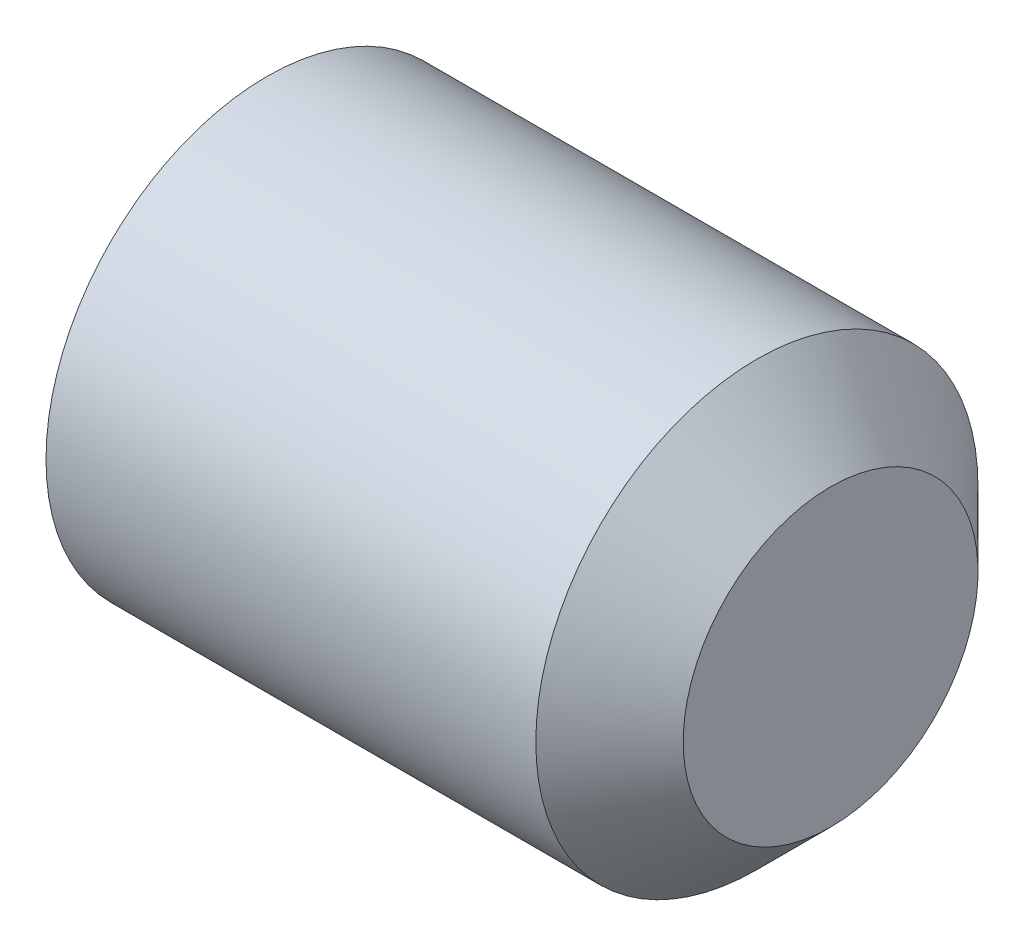
ISO-10303-21;
HEADER;
FILE_DESCRIPTION(('STEP AP214'),'2;1');
FILE_NAME('part.step','',(''),(''),'','','');
FILE_SCHEMA(('AUTOMOTIVE_DESIGN { 1 0 10303 214 1 1 1 1 }'));
ENDSEC;
DATA;
#1=APPLICATION_CONTEXT('core data for automotive mechanical design processes');
#2=APPLICATION_PROTOCOL_DEFINITION('international standard','automotive_design',2000,#1);
#3=PRODUCT_CONTEXT('',#1,'mechanical');
#4=PRODUCT('Part','Part','',(#3));
#5=PRODUCT_RELATED_PRODUCT_CATEGORY('part','',(#4));
#6=PRODUCT_DEFINITION_FORMATION('','',#4);
#7=PRODUCT_DEFINITION_CONTEXT('part definition',#1,'design');
#8=PRODUCT_DEFINITION('design','',#6,#7);
#9=PRODUCT_DEFINITION_SHAPE('','',#8);
#10=(LENGTH_UNIT() NAMED_UNIT(*) SI_UNIT(.MILLI.,.METRE.));
#11=(NAMED_UNIT(*) PLANE_ANGLE_UNIT() SI_UNIT($,.RADIAN.));
#12=(NAMED_UNIT(*) SI_UNIT($,.STERADIAN.) SOLID_ANGLE_UNIT());
#13=UNCERTAINTY_MEASURE_WITH_UNIT(LENGTH_MEASURE(1.E-05),#10,'distance_accuracy_value','');
#14=(GEOMETRIC_REPRESENTATION_CONTEXT(3) GLOBAL_UNCERTAINTY_ASSIGNED_CONTEXT((#13)) GLOBAL_UNIT_ASSIGNED_CONTEXT((#10,
#11,#12)) REPRESENTATION_CONTEXT('',''));
#15=CARTESIAN_POINT('',(0.,0.,0.));
#16=DIRECTION('',(0.,0.,1.));
#17=DIRECTION('',(1.,0.,0.));
#18=AXIS2_PLACEMENT_3D('',#15,#16,#17);
#19=CARTESIAN_POINT('',(0.5,0.,0.));
#20=DIRECTION('',(-1.,0.,0.));
#21=DIRECTION('',(0.,-1.,0.));
#22=AXIS2_PLACEMENT_3D('',#19,#20,#21);
#23=CONICAL_SURFACE('',#22,0.,1.0471975511966);
#24=CARTESIAN_POINT('',(0.,0.,0.));
#25=DIRECTION('',(-1.,0.,0.));
#26=DIRECTION('',(0.,-1.,0.));
#27=AXIS2_PLACEMENT_3D('',#24,#25,#26);
#28=CIRCLE('',#27,0.86602540378444);
#29=CARTESIAN_POINT('',(0.,0.,0.86602540378444));
#30=VERTEX_POINT('',#29);
#31=CARTESIAN_POINT('',(0.,0.75,0.433012701892223));
#32=VERTEX_POINT('',#31);
#33=EDGE_CURVE('E133',#30,#32,#28,.T.);
#34=ORIENTED_EDGE('',*,*,#33,.T.);
#35=CARTESIAN_POINT('',(-6.66799982212228E-05,0.7502,0.432897231838382));
#36=CARTESIAN_POINT('',(0.010927967254595,0.717238666576004,0.451927466563575));
#37=CARTESIAN_POINT('',(0.0209278588304375,0.68399281869625,0.471121965786389));
#38=CARTESIAN_POINT('',(0.0383842880739243,0.616925218141244,0.509843463020724));
#39=CARTESIAN_POINT('',(0.0458346476710159,0.583102272153654,0.529371149991445));
#40=CARTESIAN_POINT('',(0.0574342962607429,0.515875632570363,0.568184468451572));
#41=CARTESIAN_POINT('',(0.0616607517951382,0.482482293499614,0.58746412175321));
#42=CARTESIAN_POINT('',(0.0667098540533311,0.415538173911306,0.626114327218181));
#43=CARTESIAN_POINT('',(0.0675366780658329,0.381987637355587,0.645484738530082));
#44=CARTESIAN_POINT('',(0.0658332319602483,0.319275698978883,0.681691493033275));
#45=CARTESIAN_POINT('',(0.0637212206264609,0.290104995811374,0.698533206359488));
#46=CARTESIAN_POINT('',(0.0570222121958376,0.231953671848458,0.732106888903211));
#47=CARTESIAN_POINT('',(0.052432918046532,0.202973252776875,0.748838741655417));
#48=CARTESIAN_POINT('',(0.0409580031195667,0.144701650655193,0.782481866826481));
#49=CARTESIAN_POINT('',(0.0340236523302117,0.115417857581381,0.79938887264054));
#50=CARTESIAN_POINT('',(0.0182846224056371,0.0572874895838317,0.832950456252017));
#51=CARTESIAN_POINT('',(0.00948365081374601,0.0284401676519286,0.849605465334801));
#52=CARTESIAN_POINT('',(-6.66799982218375E-05,-0.000200000000000055,0.866140873838278));
#53=B_SPLINE_CURVE_WITH_KNOTS('',3,(#35,#36,#37,#38,#39,#40,#41,#42,#43,#44,#45,#46,#47,#48,#49,
#50,#51,#52),.UNSPECIFIED.,.F.,.F.,(4,2,2,2,2,2,2,2,4),(0.,0.118896819359341,0.238079744533805,
0.354311719456401,0.470400831872515,0.571553114284105,0.672799351342655,0.776293900714049,
0.87958477934405),.UNSPECIFIED.);
#54=EDGE_CURVE('E11',#32,#30,#53,.T.);
#55=ORIENTED_EDGE('',*,*,#54,.T.);
#56=EDGE_LOOP('',(#34,#55));
#57=FACE_BOUND('',#56,.T.);
#58=ADVANCED_FACE('F31',(#57),#23,.F.);
#59=CARTESIAN_POINT('',(0.,-0.75,0.43301270189222));
#60=VERTEX_POINT('',#59);
#61=EDGE_CURVE('E129',#60,#30,#28,.T.);
#62=ORIENTED_EDGE('',*,*,#61,.T.);
#63=CARTESIAN_POINT('',(-6.66799982219239E-05,0.000200000000000024,0.866140873838278));
#64=CARTESIAN_POINT('',(0.0109279672545945,-0.0327613334239957,0.847110639113085));
#65=CARTESIAN_POINT('',(0.0209278588304371,-0.0660071813037501,0.827916139890271));
#66=CARTESIAN_POINT('',(0.0383842880739239,-0.133074781858756,0.789194642655936));
#67=CARTESIAN_POINT('',(0.0458346476710155,-0.166897727846346,0.769666955685215));
#68=CARTESIAN_POINT('',(0.0574342962607427,-0.234124367429637,0.730853637225088));
#69=CARTESIAN_POINT('',(0.0616607517951381,-0.267517706500386,0.71157398392345));
#70=CARTESIAN_POINT('',(0.0667098540533311,-0.334461826088694,0.672923778458478));
#71=CARTESIAN_POINT('',(0.0675366780658328,-0.368012362644413,0.653553367146578));
#72=CARTESIAN_POINT('',(0.0658332319602483,-0.430724301021117,0.617346612643384));
#73=CARTESIAN_POINT('',(0.063721220626461,-0.459895004188626,0.600504899317172));
#74=CARTESIAN_POINT('',(0.0570222121958378,-0.518046328151542,0.566931216773449));
#75=CARTESIAN_POINT('',(0.0524329180465322,-0.547026747223126,0.550199364021243));
#76=CARTESIAN_POINT('',(0.040958003119567,-0.605298349344807,0.516556238850179));
#77=CARTESIAN_POINT('',(0.0340236523302121,-0.63458214241862,0.49964923303612));
#78=CARTESIAN_POINT('',(0.0182846224056376,-0.692712510416168,0.466087649424643));
#79=CARTESIAN_POINT('',(0.00948365081374657,-0.721559832348072,0.449432640341859));
#80=CARTESIAN_POINT('',(-6.66799982212897E-05,-0.7502,0.432897231838382));
#81=B_SPLINE_CURVE_WITH_KNOTS('',3,(#63,#64,#65,#66,#67,#68,#69,#70,#71,#72,#73,#74,#75,#76,#77,
#78,#79,#80),.UNSPECIFIED.,.F.,.F.,(4,2,2,2,2,2,2,2,4),(0.,0.118896819359341,0.238079744533806,
0.354311719456402,0.470400831872516,0.571553114284106,0.672799351342656,0.776293900714049,
0.87958477934405),.UNSPECIFIED.);
#82=EDGE_CURVE('E44',#30,#60,#81,.T.);
#83=ORIENTED_EDGE('',*,*,#82,.T.);
#84=EDGE_LOOP('',(#62,#83));
#85=FACE_BOUND('',#84,.T.);
#86=ADVANCED_FACE('F199',(#85),#23,.F.);
#87=CARTESIAN_POINT('',(0.,-0.75,-0.43301270189222));
#88=VERTEX_POINT('',#87);
#89=EDGE_CURVE('E128',#88,#60,#28,.T.);
#90=ORIENTED_EDGE('',*,*,#89,.T.);
#91=CARTESIAN_POINT('',(-0.278876466554599,-0.75,-1.1213588410753));
#92=CARTESIAN_POINT('',(-0.263336265513847,-0.75,-1.08897094569566));
#93=CARTESIAN_POINT('',(-0.247960254101357,-0.75,-1.05650461769235));
#94=CARTESIAN_POINT('',(-0.217622574828427,-0.75,-0.991372108674821));
#95=CARTESIAN_POINT('',(-0.202660981535683,-0.75,-0.958705892968622));
#96=CARTESIAN_POINT('',(-0.158358865523062,-0.75,-0.859967547804009));
#97=CARTESIAN_POINT('',(-0.129789394165183,-0.75,-0.793542929389712));
#98=CARTESIAN_POINT('',(-0.0751843648621229,-0.75,-0.65762475062518));
#99=CARTESIAN_POINT('',(-0.0492343798449783,-0.75,-0.588096337629301));
#100=CARTESIAN_POINT('',(-0.00305510516041315,-0.75,-0.4472488091812));
#101=CARTESIAN_POINT('',(0.0171890364428778,-0.75,-0.375934878791921));
#102=CARTESIAN_POINT('',(0.0406681724723914,-0.75,-0.267524989845908));
#103=CARTESIAN_POINT('',(0.0473436760874131,-0.75,-0.23118312239164));
#104=CARTESIAN_POINT('',(0.0579431761785596,-0.75,-0.15809165305082));
#105=CARTESIAN_POINT('',(0.0618673585946983,-0.75,-0.121342078888484));
#106=CARTESIAN_POINT('',(0.0666007642621428,-0.75,-0.0480795367926937));
#107=CARTESIAN_POINT('',(0.067446746241503,-0.75,-0.0115690096358277));
#108=CARTESIAN_POINT('',(0.0660502662725583,-0.75,0.0613915172782877));
#109=CARTESIAN_POINT('',(0.0638076130857625,-0.75,0.0978415131477214));
#110=CARTESIAN_POINT('',(0.0546612587546508,-0.75,0.187777191706421));
#111=CARTESIAN_POINT('',(0.0460435794249813,-0.75,0.241088938334563));
#112=CARTESIAN_POINT('',(0.0238197624153013,-0.75,0.346671776891812));
#113=CARTESIAN_POINT('',(0.0102076124427648,-0.75,0.398941534194197));
#114=CARTESIAN_POINT('',(-0.0209022912180242,-0.75,0.503561794942341));
#115=CARTESIAN_POINT('',(-0.0384803755428799,-0.75,0.555887795146071));
#116=CARTESIAN_POINT('',(-0.0761733658266928,-0.75,0.65957873858857));
#117=CARTESIAN_POINT('',(-0.0962873812846859,-0.75,0.710944011954183));
#118=CARTESIAN_POINT('',(-0.150040559931433,-0.75,0.841609169334977));
#119=CARTESIAN_POINT('',(-0.184929491266454,-0.75,0.92038989884234));
#120=CARTESIAN_POINT('',(-0.257158245348334,-0.75,1.07682093489163));
#121=CARTESIAN_POINT('',(-0.294498696792946,-0.75,1.15447094517097));
#122=CARTESIAN_POINT('',(-0.370753350440448,-0.75,1.30910230028643));
#123=CARTESIAN_POINT('',(-0.409669312305081,-0.75,1.38608277390296));
#124=CARTESIAN_POINT('',(-0.488505273193592,-0.75,1.53952831971992));
#125=CARTESIAN_POINT('',(-0.528425305368566,-0.75,1.61599337479695));
#126=CARTESIAN_POINT('',(-0.6051521411833,-0.75,1.76135282602859));
#127=CARTESIAN_POINT('',(-0.641896830705147,-0.75,1.83028007942956));
#128=CARTESIAN_POINT('',(-0.715804702425085,-0.75,1.9679128537899));
#129=CARTESIAN_POINT('',(-0.752967900110791,-0.75,2.0366183664215));
#130=CARTESIAN_POINT('',(-0.827513082986853,-0.75,2.17368403451686));
#131=CARTESIAN_POINT('',(-0.864894271247797,-0.75,2.24204462391346));
#132=CARTESIAN_POINT('',(-0.939899942981135,-0.75,2.37862759491475));
#133=CARTESIAN_POINT('',(-0.97752441361878,-0.75,2.44684998356505));
#134=CARTESIAN_POINT('',(-1.01523807504823,-0.75,2.51502271803409));
#135=B_SPLINE_CURVE_WITH_KNOTS('',3,(#91,#92,#93,#94,#95,#96,#97,#98,#99,#100,#101,#102,#103,
#104,#105,#106,#107,#108,#109,#110,#111,#112,#113,#114,#115,#116,#117,#118,#119,#120,#121,#122,
#123,#124,#125,#126,#127,#128,#129,#130,#131,#132,#133,#134),.UNSPECIFIED.,.F.,.F.,(4,2,2,2,2,2,
2,2,2,2,2,2,2,2,2,2,2,2,2,2,2,4),(0.,0.107767756928781,0.215554780551915,0.432420251910877,
0.654944617818952,0.876884302501298,0.987647541221339,1.0984032936094,1.20783201912744,
1.31726752042964,1.47894399847129,1.64081574297878,1.8063195007273,1.97176530228984,
2.23016383407581,2.48862889356041,2.74739105429863,3.00616176975601,3.24048926348677,
3.47482545759373,3.70856560604661,3.94229352217274),.UNSPECIFIED.);
#136=EDGE_CURVE('E175',#60,#88,#135,.F.);
#137=ORIENTED_EDGE('',*,*,#136,.T.);
#138=EDGE_LOOP('',(#90,#137));
#139=FACE_BOUND('',#138,.T.);
#140=ADVANCED_FACE('F205',(#139),#23,.F.);
#141=CARTESIAN_POINT('',(0.,0.,-0.86602540378444));
#142=VERTEX_POINT('',#141);
#143=EDGE_CURVE('E227',#142,#88,#28,.T.);
#144=ORIENTED_EDGE('',*,*,#143,.T.);
#145=CARTESIAN_POINT('',(-6.66799982213668E-05,-0.7502,-0.432897231838382));
#146=CARTESIAN_POINT('',(0.0109279672545949,-0.717238666576004,-0.451927466563575));
#147=CARTESIAN_POINT('',(0.0209278588304375,-0.68399281869625,-0.471121965786389));
#148=CARTESIAN_POINT('',(0.0383842880739244,-0.616925218141244,-0.509843463020723));
#149=CARTESIAN_POINT('',(0.045834647671016,-0.583102272153655,-0.529371149991445));
#150=CARTESIAN_POINT('',(0.057434296260743,-0.515875632570363,-0.568184468451572));
#151=CARTESIAN_POINT('',(0.0616607517951382,-0.482482293499614,-0.587464121753209));
#152=CARTESIAN_POINT('',(0.0667098540533311,-0.415538173911306,-0.626114327218181));
#153=CARTESIAN_POINT('',(0.0675366780658329,-0.381987637355587,-0.645484738530082));
#154=CARTESIAN_POINT('',(0.0658332319602482,-0.319275698978883,-0.681691493033275));
#155=CARTESIAN_POINT('',(0.0637212206264608,-0.290104995811374,-0.698533206359488));
#156=CARTESIAN_POINT('',(0.0570222121958375,-0.231953671848458,-0.732106888903211));
#157=CARTESIAN_POINT('',(0.052432918046532,-0.202973252776875,-0.748838741655417));
#158=CARTESIAN_POINT('',(0.0409580031195667,-0.144701650655193,-0.782481866826481));
#159=CARTESIAN_POINT('',(0.0340236523302117,-0.115417857581381,-0.79938887264054));
#160=CARTESIAN_POINT('',(0.018284622405637,-0.0572874895838317,-0.832950456252017));
#161=CARTESIAN_POINT('',(0.00948365081374596,-0.0284401676519285,-0.849605465334801));
#162=CARTESIAN_POINT('',(-6.6679998221836E-05,0.000199999999999981,-0.866140873838278));
#163=B_SPLINE_CURVE_WITH_KNOTS('',3,(#145,#146,#147,#148,#149,#150,#151,#152,#153,#154,#155,
#156,#157,#158,#159,#160,#161,#162),.UNSPECIFIED.,.F.,.F.,(4,2,2,2,2,2,2,2,4),(0.,
0.118896819359341,0.238079744533805,0.354311719456401,0.470400831872515,0.571553114284105,
0.672799351342655,0.776293900714049,0.87958477934405),.UNSPECIFIED.);
#164=EDGE_CURVE('E170',#88,#142,#163,.T.);
#165=ORIENTED_EDGE('',*,*,#164,.T.);
#166=EDGE_LOOP('',(#144,#165));
#167=FACE_BOUND('',#166,.T.);
#168=ADVANCED_FACE('F217',(#167),#23,.F.);
#169=CARTESIAN_POINT('',(0.,0.75,-0.43301270189222));
#170=VERTEX_POINT('',#169);
#171=EDGE_CURVE('E225',#170,#142,#28,.T.);
#172=ORIENTED_EDGE('',*,*,#171,.T.);
#173=CARTESIAN_POINT('',(-6.66799982219239E-05,-0.000200000000000024,-0.866140873838278));
#174=CARTESIAN_POINT('',(0.0109279672545945,0.0327613334239957,-0.847110639113085));
#175=CARTESIAN_POINT('',(0.0209278588304371,0.0660071813037502,-0.827916139890271));
#176=CARTESIAN_POINT('',(0.038384288073924,0.133074781858756,-0.789194642655936));
#177=CARTESIAN_POINT('',(0.0458346476710156,0.166897727846346,-0.769666955685215));
#178=CARTESIAN_POINT('',(0.0574342962607428,0.234124367429637,-0.730853637225088));
#179=CARTESIAN_POINT('',(0.0616607517951381,0.267517706500386,-0.71157398392345));
#180=CARTESIAN_POINT('',(0.0667098540533311,0.334461826088694,-0.672923778458478));
#181=CARTESIAN_POINT('',(0.067536678065833,0.368012362644413,-0.653553367146578));
#182=CARTESIAN_POINT('',(0.0658332319602484,0.430724301021117,-0.617346612643384));
#183=CARTESIAN_POINT('',(0.063721220626461,0.459895004188626,-0.600504899317172));
#184=CARTESIAN_POINT('',(0.0570222121958378,0.518046328151543,-0.566931216773449));
#185=CARTESIAN_POINT('',(0.0524329180465322,0.547026747223125,-0.550199364021243));
#186=CARTESIAN_POINT('',(0.040958003119567,0.605298349344807,-0.516556238850179));
#187=CARTESIAN_POINT('',(0.0340236523302121,0.634582142418619,-0.49964923303612));
#188=CARTESIAN_POINT('',(0.0182846224056376,0.692712510416168,-0.466087649424643));
#189=CARTESIAN_POINT('',(0.00948365081374655,0.721559832348072,-0.449432640341859));
#190=CARTESIAN_POINT('',(-6.66799982212116E-05,0.7502,-0.432897231838382));
#191=B_SPLINE_CURVE_WITH_KNOTS('',3,(#173,#174,#175,#176,#177,#178,#179,#180,#181,#182,#183,
#184,#185,#186,#187,#188,#189,#190),.UNSPECIFIED.,.F.,.F.,(4,2,2,2,2,2,2,2,4),(0.,
0.118896819359341,0.238079744533806,0.354311719456402,0.470400831872516,0.571553114284106,
0.672799351342656,0.776293900714049,0.87958477934405),.UNSPECIFIED.);
#192=EDGE_CURVE('E111',#142,#170,#191,.T.);
#193=ORIENTED_EDGE('',*,*,#192,.T.);
#194=EDGE_LOOP('',(#172,#193));
#195=FACE_BOUND('',#194,.T.);
#196=ADVANCED_FACE('F209',(#195),#23,.F.);
#197=EDGE_CURVE('E221',#32,#170,#28,.T.);
#198=ORIENTED_EDGE('',*,*,#197,.T.);
#199=CARTESIAN_POINT('',(-0.278876466554599,0.75,-1.1213588410753));
#200=CARTESIAN_POINT('',(-0.263336265513847,0.75,-1.08897094569566));
#201=CARTESIAN_POINT('',(-0.247960254101357,0.75,-1.05650461769235));
#202=CARTESIAN_POINT('',(-0.217622574828427,0.75,-0.991372108674821));
#203=CARTESIAN_POINT('',(-0.202660981535683,0.75,-0.958705892968622));
#204=CARTESIAN_POINT('',(-0.158358865523062,0.75,-0.859967547804009));
#205=CARTESIAN_POINT('',(-0.129789394165183,0.75,-0.793542929389712));
#206=CARTESIAN_POINT('',(-0.0751843648621227,0.75,-0.657624750625179));
#207=CARTESIAN_POINT('',(-0.0492343798449782,0.75,-0.588096337629301));
#208=CARTESIAN_POINT('',(-0.00305510516041308,0.75,-0.4472488091812));
#209=CARTESIAN_POINT('',(0.0171890364428778,0.75,-0.375934878791921));
#210=CARTESIAN_POINT('',(0.0406681724723914,0.75,-0.267524989845907));
#211=CARTESIAN_POINT('',(0.0473436760874131,0.75,-0.23118312239164));
#212=CARTESIAN_POINT('',(0.0579431761785596,0.75,-0.15809165305082));
#213=CARTESIAN_POINT('',(0.0618673585946983,0.75,-0.121342078888484));
#214=CARTESIAN_POINT('',(0.0666007642621429,0.75,-0.0480795367926939));
#215=CARTESIAN_POINT('',(0.067446746241503,0.75,-0.011569009635828));
#216=CARTESIAN_POINT('',(0.0660502662725583,0.75,0.0613915172782875));
#217=CARTESIAN_POINT('',(0.0638076130857626,0.75,0.0978415131477212));
#218=CARTESIAN_POINT('',(0.0546612587546508,0.75,0.18777719170642));
#219=CARTESIAN_POINT('',(0.0460435794249812,0.75,0.241088938334563));
#220=CARTESIAN_POINT('',(0.0238197624153013,0.75,0.346671776891812));
#221=CARTESIAN_POINT('',(0.010207612442765,0.75,0.398941534194197));
#222=CARTESIAN_POINT('',(-0.020902291218024,0.75,0.503561794942341));
#223=CARTESIAN_POINT('',(-0.0384803755428797,0.75,0.555887795146071));
#224=CARTESIAN_POINT('',(-0.0761733658266927,0.75,0.659578738588569));
#225=CARTESIAN_POINT('',(-0.0962873812846858,0.75,0.710944011954183));
#226=CARTESIAN_POINT('',(-0.150040559931433,0.75,0.841609169334978));
#227=CARTESIAN_POINT('',(-0.184929491266454,0.75,0.92038989884234));
#228=CARTESIAN_POINT('',(-0.257158245348334,0.75,1.07682093489163));
#229=CARTESIAN_POINT('',(-0.294498696792946,0.75,1.15447094517097));
#230=CARTESIAN_POINT('',(-0.370753350440448,0.75,1.30910230028643));
#231=CARTESIAN_POINT('',(-0.409669312305082,0.75,1.38608277390296));
#232=CARTESIAN_POINT('',(-0.488505273193592,0.75,1.53952831971992));
#233=CARTESIAN_POINT('',(-0.528425305368566,0.75,1.61599337479695));
#234=CARTESIAN_POINT('',(-0.6051521411833,0.75,1.76135282602859));
#235=CARTESIAN_POINT('',(-0.641896830705147,0.75,1.83028007942957));
#236=CARTESIAN_POINT('',(-0.715804702425085,0.75,1.9679128537899));
#237=CARTESIAN_POINT('',(-0.752967900110791,0.75,2.0366183664215));
#238=CARTESIAN_POINT('',(-0.827513082986853,0.75,2.17368403451686));
#239=CARTESIAN_POINT('',(-0.864894271247797,0.75,2.24204462391346));
#240=CARTESIAN_POINT('',(-0.939899942981135,0.75,2.37862759491475));
#241=CARTESIAN_POINT('',(-0.97752441361878,0.75,2.44684998356505));
#242=CARTESIAN_POINT('',(-1.01523807504823,0.75,2.51502271803409));
#243=B_SPLINE_CURVE_WITH_KNOTS('',3,(#199,#200,#201,#202,#203,#204,#205,#206,#207,#208,#209,
#210,#211,#212,#213,#214,#215,#216,#217,#218,#219,#220,#221,#222,#223,#224,#225,#226,#227,#228,
#229,#230,#231,#232,#233,#234,#235,#236,#237,#238,#239,#240,#241,#242),.UNSPECIFIED.,.F.,.F.,(4,
2,2,2,2,2,2,2,2,2,2,2,2,2,2,2,2,2,2,2,2,4),(0.,0.107767756928781,0.215554780551916,
0.432420251910878,0.654944617818952,0.876884302501298,0.987647541221339,1.0984032936094,
1.20783201912744,1.31726752042964,1.47894399847129,1.64081574297878,1.8063195007273,
1.97176530228984,2.23016383407581,2.48862889356041,2.74739105429863,3.00616176975601,
3.24048926348677,3.47482545759373,3.70856560604661,3.94229352217274),.UNSPECIFIED.);
#244=EDGE_CURVE('E77',#170,#32,#243,.T.);
#245=ORIENTED_EDGE('',*,*,#244,.T.);
#246=EDGE_LOOP('',(#198,#245));
#247=FACE_BOUND('',#246,.T.);
#248=ADVANCED_FACE('F201',(#247),#23,.F.);
#249=CARTESIAN_POINT('',(4.,0.,0.));
#250=DIRECTION('',(1.,0.,0.));
#251=DIRECTION('',(0.,1.,0.));
#252=AXIS2_PLACEMENT_3D('',#249,#250,#251);
#253=PLANE('',#252);
#254=CARTESIAN_POINT('',(4.,0.,0.));
#255=DIRECTION('',(-1.,0.,0.));
#256=DIRECTION('',(0.,-1.,0.));
#257=AXIS2_PLACEMENT_3D('',#254,#255,#256);
#258=CIRCLE('',#257,1.);
#259=CARTESIAN_POINT('',(4.,-1.,0.));
#260=VERTEX_POINT('',#259);
#261=EDGE_CURVE('E142',#260,#260,#258,.T.);
#262=ORIENTED_EDGE('',*,*,#261,.F.);
#263=EDGE_LOOP('',(#262));
#264=FACE_BOUND('',#263,.T.);
#265=ADVANCED_FACE('F33',(#264),#253,.T.);
#266=CARTESIAN_POINT('',(3.5,0.,0.));
#267=DIRECTION('',(-1.,0.,0.));
#268=DIRECTION('',(0.,-1.,0.));
#269=AXIS2_PLACEMENT_3D('',#266,#267,#268);
#270=CONICAL_SURFACE('',#269,1.5,0.785398163397448);
#271=ORIENTED_EDGE('',*,*,#261,.T.);
#272=EDGE_LOOP('',(#271));
#273=FACE_BOUND('',#272,.T.);
#274=CARTESIAN_POINT('',(3.5,0.,0.));
#275=DIRECTION('',(-1.,0.,0.));
#276=DIRECTION('',(0.,-1.,0.));
#277=AXIS2_PLACEMENT_3D('',#274,#275,#276);
#278=CIRCLE('',#277,1.5);
#279=CARTESIAN_POINT('',(3.5,-1.5,0.));
#280=VERTEX_POINT('',#279);
#281=EDGE_CURVE('E139',#280,#280,#278,.T.);
#282=ORIENTED_EDGE('',*,*,#281,.F.);
#283=EDGE_LOOP('',(#282));
#284=FACE_BOUND('',#283,.T.);
#285=ADVANCED_FACE('F215',(#273,#284),#270,.T.);
#286=CARTESIAN_POINT('',(0.5,0.,0.));
#287=DIRECTION('',(-1.,0.,0.));
#288=DIRECTION('',(0.,-1.,0.));
#289=AXIS2_PLACEMENT_3D('',#286,#287,#288);
#290=CYLINDRICAL_SURFACE('',#289,1.5);
#291=ORIENTED_EDGE('',*,*,#281,.T.);
#292=EDGE_LOOP('',(#291));
#293=FACE_BOUND('',#292,.T.);
#294=CARTESIAN_POINT('',(0.17695785750662,0.,0.));
#295=DIRECTION('',(-1.,0.,0.));
#296=DIRECTION('',(0.,-1.,0.));
#297=AXIS2_PLACEMENT_3D('',#294,#295,#296);
#298=CIRCLE('',#297,1.5);
#299=CARTESIAN_POINT('',(0.17695785750662,-1.5,0.));
#300=VERTEX_POINT('',#299);
#301=EDGE_CURVE('E136',#300,#300,#298,.T.);
#302=ORIENTED_EDGE('',*,*,#301,.F.);
#303=EDGE_LOOP('',(#302));
#304=FACE_BOUND('',#303,.T.);
#305=ADVANCED_FACE('F324',(#293,#304),#290,.T.);
#306=CARTESIAN_POINT('',(0.,0.,0.));
#307=DIRECTION('',(1.,0.,0.));
#308=DIRECTION('',(0.,1.,0.));
#309=AXIS2_PLACEMENT_3D('',#306,#307,#308);
#310=CONICAL_SURFACE('',#309,1.1935,1.0471975511966);
#311=ORIENTED_EDGE('',*,*,#301,.T.);
#312=EDGE_LOOP('',(#311));
#313=FACE_BOUND('',#312,.T.);
#314=CARTESIAN_POINT('',(0.,0.,0.));
#315=DIRECTION('',(-1.,0.,0.));
#316=DIRECTION('',(0.,-1.,0.));
#317=AXIS2_PLACEMENT_3D('',#314,#315,#316);
#318=CIRCLE('',#317,1.1935);
#319=CARTESIAN_POINT('',(0.,-1.1935,0.));
#320=VERTEX_POINT('',#319);
#321=EDGE_CURVE('E132',#320,#320,#318,.T.);
#322=ORIENTED_EDGE('',*,*,#321,.F.);
#323=EDGE_LOOP('',(#322));
#324=FACE_BOUND('',#323,.T.);
#325=ADVANCED_FACE('F196',(#313,#324),#310,.T.);
#326=CARTESIAN_POINT('',(0.,-1.1935,0.));
#327=DIRECTION('',(-1.,0.,0.));
#328=DIRECTION('',(0.,-1.,0.));
#329=AXIS2_PLACEMENT_3D('',#326,#327,#328);
#330=PLANE('',#329);
#331=ORIENTED_EDGE('',*,*,#321,.T.);
#332=EDGE_LOOP('',(#331));
#333=FACE_BOUND('',#332,.T.);
#334=ORIENTED_EDGE('',*,*,#61,.F.);
#335=ORIENTED_EDGE('',*,*,#89,.F.);
#336=ORIENTED_EDGE('',*,*,#143,.F.);
#337=ORIENTED_EDGE('',*,*,#171,.F.);
#338=ORIENTED_EDGE('',*,*,#197,.F.);
#339=ORIENTED_EDGE('',*,*,#33,.F.);
#340=EDGE_LOOP('',(#334,#335,#336,#337,#338,#339));
#341=FACE_BOUND('',#340,.T.);
#342=ADVANCED_FACE('F191',(#333,#341),#330,.T.);
#343=CARTESIAN_POINT('',(1.2,0.75,0.43301270189222));
#344=DIRECTION('',(0.,-0.500000000000001,-0.866025403784438));
#345=DIRECTION('',(0.,0.866025403784438,-0.500000000000001));
#346=AXIS2_PLACEMENT_3D('',#343,#344,#345);
#347=PLANE('',#346);
#348=DIRECTION('',(-1.,0.,0.));
#349=VECTOR('',#348,1.);
#350=CARTESIAN_POINT('',(1.2,0.75,0.43301270189222));
#351=LINE('',#350,#349);
#352=CARTESIAN_POINT('',(1.2,0.75,0.43301270189222));
#353=VERTEX_POINT('',#352);
#354=EDGE_CURVE('E51',#353,#32,#351,.T.);
#355=ORIENTED_EDGE('',*,*,#354,.F.);
#356=DIRECTION('',(0.,-0.866025403784438,0.500000000000001));
#357=VECTOR('',#356,1.);
#358=CARTESIAN_POINT('',(1.2,0.75,0.43301270189222));
#359=LINE('',#358,#357);
#360=CARTESIAN_POINT('',(1.2,0.,0.86602540378444));
#361=VERTEX_POINT('',#360);
#362=EDGE_CURVE('E237',#353,#361,#359,.T.);
#363=ORIENTED_EDGE('',*,*,#362,.T.);
#364=DIRECTION('',(-1.,0.,0.));
#365=VECTOR('',#364,1.);
#366=CARTESIAN_POINT('',(1.2,0.,0.86602540378444));
#367=LINE('',#366,#365);
#368=EDGE_CURVE('E125',#361,#30,#367,.T.);
#369=ORIENTED_EDGE('',*,*,#368,.T.);
#370=ORIENTED_EDGE('',*,*,#54,.F.);
#371=EDGE_LOOP('',(#355,#363,#369,#370));
#372=FACE_BOUND('',#371,.T.);
#373=ADVANCED_FACE('F187',(#372),#347,.T.);
#374=CARTESIAN_POINT('',(1.2,0.,0.86602540378444));
#375=DIRECTION('',(0.,0.500000000000001,-0.866025403784438));
#376=DIRECTION('',(0.,0.866025403784438,0.500000000000001));
#377=AXIS2_PLACEMENT_3D('',#374,#375,#376);
#378=PLANE('',#377);
#379=ORIENTED_EDGE('',*,*,#368,.F.);
#380=DIRECTION('',(0.,-0.866025403784438,-0.500000000000001));
#381=VECTOR('',#380,1.);
#382=CARTESIAN_POINT('',(1.2,0.,0.86602540378444));
#383=LINE('',#382,#381);
#384=CARTESIAN_POINT('',(1.2,-0.75,0.43301270189222));
#385=VERTEX_POINT('',#384);
#386=EDGE_CURVE('E86',#361,#385,#383,.T.);
#387=ORIENTED_EDGE('',*,*,#386,.T.);
#388=DIRECTION('',(-1.,0.,0.));
#389=VECTOR('',#388,1.);
#390=CARTESIAN_POINT('',(1.2,-0.75,0.43301270189222));
#391=LINE('',#390,#389);
#392=EDGE_CURVE('E122',#385,#60,#391,.T.);
#393=ORIENTED_EDGE('',*,*,#392,.T.);
#394=ORIENTED_EDGE('',*,*,#82,.F.);
#395=EDGE_LOOP('',(#379,#387,#393,#394));
#396=FACE_BOUND('',#395,.T.);
#397=ADVANCED_FACE('F184',(#396),#378,.T.);
#398=CARTESIAN_POINT('',(1.2,-0.75,0.43301270189222));
#399=DIRECTION('',(0.,1.,0.));
#400=DIRECTION('',(0.,0.,1.));
#401=AXIS2_PLACEMENT_3D('',#398,#399,#400);
#402=PLANE('',#401);
#403=ORIENTED_EDGE('',*,*,#392,.F.);
#404=DIRECTION('',(0.,0.,-1.));
#405=VECTOR('',#404,1.);
#406=CARTESIAN_POINT('',(1.2,-0.75,0.43301270189222));
#407=LINE('',#406,#405);
#408=CARTESIAN_POINT('',(1.2,-0.75,-0.43301270189222));
#409=VERTEX_POINT('',#408);
#410=EDGE_CURVE('E106',#385,#409,#407,.T.);
#411=ORIENTED_EDGE('',*,*,#410,.T.);
#412=DIRECTION('',(-1.,0.,0.));
#413=VECTOR('',#412,1.);
#414=CARTESIAN_POINT('',(1.2,-0.75,-0.43301270189222));
#415=LINE('',#414,#413);
#416=EDGE_CURVE('E103',#409,#88,#415,.T.);
#417=ORIENTED_EDGE('',*,*,#416,.T.);
#418=ORIENTED_EDGE('',*,*,#136,.F.);
#419=EDGE_LOOP('',(#403,#411,#417,#418));
#420=FACE_BOUND('',#419,.T.);
#421=ADVANCED_FACE('F167',(#420),#402,.T.);
#422=CARTESIAN_POINT('',(1.2,-0.75,-0.43301270189222));
#423=DIRECTION('',(0.,0.500000000000001,0.866025403784438));
#424=DIRECTION('',(0.,-0.866025403784438,0.500000000000001));
#425=AXIS2_PLACEMENT_3D('',#422,#423,#424);
#426=PLANE('',#425);
#427=ORIENTED_EDGE('',*,*,#416,.F.);
#428=DIRECTION('',(0.,0.866025403784438,-0.500000000000001));
#429=VECTOR('',#428,1.);
#430=CARTESIAN_POINT('',(1.2,-0.75,-0.43301270189222));
#431=LINE('',#430,#429);
#432=CARTESIAN_POINT('',(1.2,0.,-0.86602540378444));
#433=VERTEX_POINT('',#432);
#434=EDGE_CURVE('E97',#409,#433,#431,.T.);
#435=ORIENTED_EDGE('',*,*,#434,.T.);
#436=DIRECTION('',(-1.,0.,0.));
#437=VECTOR('',#436,1.);
#438=CARTESIAN_POINT('',(1.2,0.,-0.86602540378444));
#439=LINE('',#438,#437);
#440=EDGE_CURVE('E100',#433,#142,#439,.T.);
#441=ORIENTED_EDGE('',*,*,#440,.T.);
#442=ORIENTED_EDGE('',*,*,#164,.F.);
#443=EDGE_LOOP('',(#427,#435,#441,#442));
#444=FACE_BOUND('',#443,.T.);
#445=ADVANCED_FACE('F99',(#444),#426,.T.);
#446=CARTESIAN_POINT('',(1.2,0.,-0.86602540378444));
#447=DIRECTION('',(0.,-0.500000000000001,0.866025403784438));
#448=DIRECTION('',(0.,-0.866025403784438,-0.500000000000001));
#449=AXIS2_PLACEMENT_3D('',#446,#447,#448);
#450=PLANE('',#449);
#451=ORIENTED_EDGE('',*,*,#440,.F.);
#452=DIRECTION('',(0.,0.866025403784438,0.500000000000001));
#453=VECTOR('',#452,1.);
#454=CARTESIAN_POINT('',(1.2,0.,-0.86602540378444));
#455=LINE('',#454,#453);
#456=CARTESIAN_POINT('',(1.2,0.75,-0.43301270189222));
#457=VERTEX_POINT('',#456);
#458=EDGE_CURVE('E105',#433,#457,#455,.T.);
#459=ORIENTED_EDGE('',*,*,#458,.T.);
#460=DIRECTION('',(-1.,0.,0.));
#461=VECTOR('',#460,1.);
#462=CARTESIAN_POINT('',(1.2,0.75,-0.43301270189222));
#463=LINE('',#462,#461);
#464=EDGE_CURVE('E112',#457,#170,#463,.T.);
#465=ORIENTED_EDGE('',*,*,#464,.T.);
#466=ORIENTED_EDGE('',*,*,#192,.F.);
#467=EDGE_LOOP('',(#451,#459,#465,#466));
#468=FACE_BOUND('',#467,.T.);
#469=ADVANCED_FACE('F109',(#468),#450,.T.);
#470=CARTESIAN_POINT('',(1.2,0.75,-0.43301270189222));
#471=DIRECTION('',(0.,-1.,0.));
#472=DIRECTION('',(0.,0.,-1.));
#473=AXIS2_PLACEMENT_3D('',#470,#471,#472);
#474=PLANE('',#473);
#475=ORIENTED_EDGE('',*,*,#464,.F.);
#476=DIRECTION('',(0.,0.,1.));
#477=VECTOR('',#476,1.);
#478=CARTESIAN_POINT('',(1.2,0.75,-0.43301270189222));
#479=LINE('',#478,#477);
#480=EDGE_CURVE('E57',#457,#353,#479,.T.);
#481=ORIENTED_EDGE('',*,*,#480,.T.);
#482=ORIENTED_EDGE('',*,*,#354,.T.);
#483=ORIENTED_EDGE('',*,*,#244,.F.);
#484=EDGE_LOOP('',(#475,#481,#482,#483));
#485=FACE_BOUND('',#484,.T.);
#486=ADVANCED_FACE('F157',(#485),#474,.T.);
#487=CARTESIAN_POINT('',(1.2,0.,0.86602540378444));
#488=DIRECTION('',(1.,0.,0.));
#489=DIRECTION('',(0.,0.,-1.));
#490=AXIS2_PLACEMENT_3D('',#487,#488,#489);
#491=PLANE('',#490);
#492=ORIENTED_EDGE('',*,*,#362,.F.);
#493=ORIENTED_EDGE('',*,*,#480,.F.);
#494=ORIENTED_EDGE('',*,*,#458,.F.);
#495=ORIENTED_EDGE('',*,*,#434,.F.);
#496=ORIENTED_EDGE('',*,*,#410,.F.);
#497=ORIENTED_EDGE('',*,*,#386,.F.);
#498=EDGE_LOOP('',(#492,#493,#494,#495,#496,#497));
#499=FACE_BOUND('',#498,.T.);
#500=ADVANCED_FACE('F114',(#499),#491,.F.);
#501=CLOSED_SHELL('',(#58,#86,#140,#168,#196,#248,#265,#285,#305,#325,#342,#373,#397,#421,#445,
#469,#486,#500));
#502=MANIFOLD_SOLID_BREP('B2',#501);
#503=ADVANCED_BREP_SHAPE_REPRESENTATION('',(#18,#502),#14);
#504=SHAPE_DEFINITION_REPRESENTATION(#9,#503);
ENDSEC;
END-ISO-10303-21;
